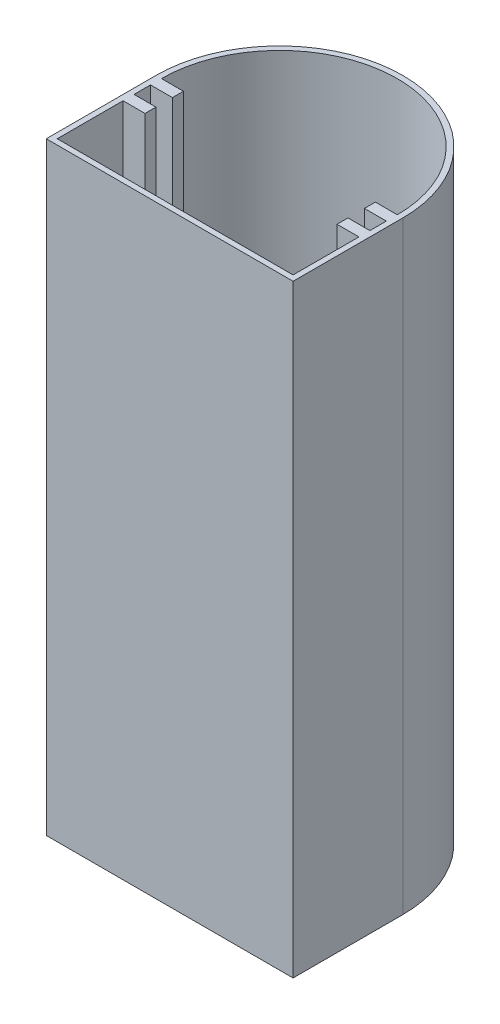
ISO-10303-21;
HEADER;
FILE_DESCRIPTION(('STEP AP214'),'2;1');
FILE_NAME('part.step','',(''),(''),'','','');
FILE_SCHEMA(('AUTOMOTIVE_DESIGN { 1 0 10303 214 1 1 1 1 }'));
ENDSEC;
DATA;
#1=APPLICATION_CONTEXT('core data for automotive mechanical design processes');
#2=APPLICATION_PROTOCOL_DEFINITION('international standard','automotive_design',2000,#1);
#3=PRODUCT_CONTEXT('',#1,'mechanical');
#4=PRODUCT('Part','Part','',(#3));
#5=PRODUCT_RELATED_PRODUCT_CATEGORY('part','',(#4));
#6=PRODUCT_DEFINITION_FORMATION('','',#4);
#7=PRODUCT_DEFINITION_CONTEXT('part definition',#1,'design');
#8=PRODUCT_DEFINITION('design','',#6,#7);
#9=PRODUCT_DEFINITION_SHAPE('','',#8);
#10=(LENGTH_UNIT() NAMED_UNIT(*) SI_UNIT(.MILLI.,.METRE.));
#11=(NAMED_UNIT(*) PLANE_ANGLE_UNIT() SI_UNIT($,.RADIAN.));
#12=(NAMED_UNIT(*) SI_UNIT($,.STERADIAN.) SOLID_ANGLE_UNIT());
#13=UNCERTAINTY_MEASURE_WITH_UNIT(LENGTH_MEASURE(1.E-05),#10,'distance_accuracy_value','');
#14=(GEOMETRIC_REPRESENTATION_CONTEXT(3) GLOBAL_UNCERTAINTY_ASSIGNED_CONTEXT((#13)) GLOBAL_UNIT_ASSIGNED_CONTEXT((#10,
#11,#12)) REPRESENTATION_CONTEXT('',''));
#15=CARTESIAN_POINT('',(0.,0.,0.));
#16=DIRECTION('',(0.,0.,1.));
#17=DIRECTION('',(1.,0.,0.));
#18=AXIS2_PLACEMENT_3D('',#15,#16,#17);
#19=CARTESIAN_POINT('',(-43.8830935251799,110.,1.70773381294964));
#20=DIRECTION('',(0.,0.,-1.));
#21=DIRECTION('',(-1.,0.,0.));
#22=AXIS2_PLACEMENT_3D('',#19,#20,#21);
#23=PLANE('',#22);
#24=DIRECTION('',(1.,0.,0.));
#25=VECTOR('',#24,1.);
#26=CARTESIAN_POINT('',(-43.8830935251799,0.,1.70773381294964));
#27=LINE('',#26,#25);
#28=CARTESIAN_POINT('',(-43.8830935251799,0.,1.70773381294964));
#29=VERTEX_POINT('',#28);
#30=CARTESIAN_POINT('',(1.11690647482014,0.,1.70773381294964));
#31=VERTEX_POINT('',#30);
#32=EDGE_CURVE('E311',#29,#31,#27,.T.);
#33=ORIENTED_EDGE('',*,*,#32,.T.);
#34=DIRECTION('',(0.,-1.,0.));
#35=VECTOR('',#34,1.);
#36=CARTESIAN_POINT('',(1.11690647482014,110.,1.70773381294964));
#37=LINE('',#36,#35);
#38=CARTESIAN_POINT('',(1.11690647482014,110.,1.70773381294964));
#39=VERTEX_POINT('',#38);
#40=EDGE_CURVE('E11',#39,#31,#37,.T.);
#41=ORIENTED_EDGE('',*,*,#40,.F.);
#42=DIRECTION('',(1.,0.,0.));
#43=VECTOR('',#42,1.);
#44=CARTESIAN_POINT('',(-43.8830935251799,110.,1.70773381294964));
#45=LINE('',#44,#43);
#46=CARTESIAN_POINT('',(-43.8830935251799,110.,1.70773381294964));
#47=VERTEX_POINT('',#46);
#48=EDGE_CURVE('E343',#47,#39,#45,.T.);
#49=ORIENTED_EDGE('',*,*,#48,.F.);
#50=DIRECTION('',(0.,-1.,0.));
#51=VECTOR('',#50,1.);
#52=CARTESIAN_POINT('',(-43.8830935251799,110.,1.70773381294964));
#53=LINE('',#52,#51);
#54=EDGE_CURVE('E57',#47,#29,#53,.T.);
#55=ORIENTED_EDGE('',*,*,#54,.T.);
#56=EDGE_LOOP('',(#33,#41,#49,#55));
#57=FACE_BOUND('',#56,.T.);
#58=ADVANCED_FACE('F33',(#57),#23,.F.);
#59=CARTESIAN_POINT('',(1.11690647482014,110.,1.70773381294964));
#60=DIRECTION('',(-1.,0.,0.));
#61=DIRECTION('',(0.,0.,1.));
#62=AXIS2_PLACEMENT_3D('',#59,#60,#61);
#63=PLANE('',#62);
#64=DIRECTION('',(0.,0.,-1.));
#65=VECTOR('',#64,1.);
#66=CARTESIAN_POINT('',(1.11690647482014,0.,1.70773381294964));
#67=LINE('',#66,#65);
#68=CARTESIAN_POINT('',(1.11690647482014,0.,-18.2922661870504));
#69=VERTEX_POINT('',#68);
#70=EDGE_CURVE('E352',#31,#69,#67,.T.);
#71=ORIENTED_EDGE('',*,*,#70,.T.);
#72=DIRECTION('',(0.,-1.,0.));
#73=VECTOR('',#72,1.);
#74=CARTESIAN_POINT('',(1.11690647482014,110.,-18.2922661870504));
#75=LINE('',#74,#73);
#76=CARTESIAN_POINT('',(1.11690647482014,110.,-18.2922661870504));
#77=VERTEX_POINT('',#76);
#78=EDGE_CURVE('E41',#77,#69,#75,.T.);
#79=ORIENTED_EDGE('',*,*,#78,.F.);
#80=DIRECTION('',(0.,0.,-1.));
#81=VECTOR('',#80,1.);
#82=CARTESIAN_POINT('',(1.11690647482014,110.,1.70773381294964));
#83=LINE('',#82,#81);
#84=EDGE_CURVE('E83',#39,#77,#83,.T.);
#85=ORIENTED_EDGE('',*,*,#84,.F.);
#86=ORIENTED_EDGE('',*,*,#40,.T.);
#87=EDGE_LOOP('',(#71,#79,#85,#86));
#88=FACE_BOUND('',#87,.T.);
#89=ADVANCED_FACE('F375',(#88),#63,.F.);
#90=CARTESIAN_POINT('',(-21.3830935251799,110.,-18.2922661870504));
#91=DIRECTION('',(0.,-1.,0.));
#92=DIRECTION('',(0.,0.,-1.));
#93=AXIS2_PLACEMENT_3D('',#90,#91,#92);
#94=CYLINDRICAL_SURFACE('',#93,22.5);
#95=CARTESIAN_POINT('',(-21.3830935251799,0.,-18.2922661870504));
#96=DIRECTION('',(0.,1.,0.));
#97=DIRECTION('',(0.,0.,1.));
#98=AXIS2_PLACEMENT_3D('',#95,#96,#97);
#99=CIRCLE('',#98,22.5);
#100=CARTESIAN_POINT('',(-43.8830935251799,0.,-18.2922661870504));
#101=VERTEX_POINT('',#100);
#102=EDGE_CURVE('E354',#69,#101,#99,.T.);
#103=ORIENTED_EDGE('',*,*,#102,.T.);
#104=DIRECTION('',(0.,-1.,0.));
#105=VECTOR('',#104,1.);
#106=CARTESIAN_POINT('',(-43.8830935251799,110.,-18.2922661870504));
#107=LINE('',#106,#105);
#108=CARTESIAN_POINT('',(-43.8830935251799,110.,-18.2922661870504));
#109=VERTEX_POINT('',#108);
#110=EDGE_CURVE('E360',#109,#101,#107,.T.);
#111=ORIENTED_EDGE('',*,*,#110,.F.);
#112=CARTESIAN_POINT('',(-21.3830935251799,110.,-18.2922661870504));
#113=DIRECTION('',(0.,1.,0.));
#114=DIRECTION('',(0.,0.,1.));
#115=AXIS2_PLACEMENT_3D('',#112,#113,#114);
#116=CIRCLE('',#115,22.5);
#117=EDGE_CURVE('E347',#77,#109,#116,.T.);
#118=ORIENTED_EDGE('',*,*,#117,.F.);
#119=ORIENTED_EDGE('',*,*,#78,.T.);
#120=EDGE_LOOP('',(#103,#111,#118,#119));
#121=FACE_BOUND('',#120,.T.);
#122=ADVANCED_FACE('F366',(#121),#94,.T.);
#123=CARTESIAN_POINT('',(-43.8830935251799,110.,1.70773381294964));
#124=DIRECTION('',(-1.,0.,0.));
#125=DIRECTION('',(0.,0.,1.));
#126=AXIS2_PLACEMENT_3D('',#123,#124,#125);
#127=PLANE('',#126);
#128=CARTESIAN_POINT('',(-43.8830935251799,55.,-4.95893285371703));
#129=DIRECTION('',(-1.,0.,0.));
#130=DIRECTION('',(0.,0.,1.));
#131=AXIS2_PLACEMENT_3D('',#128,#129,#130);
#132=CIRCLE('',#131,2.87500000000001);
#133=CARTESIAN_POINT('',(-43.8830935251799,55.,-2.08393285371702));
#134=VERTEX_POINT('',#133);
#135=EDGE_CURVE('E217',#134,#134,#132,.T.);
#136=ORIENTED_EDGE('',*,*,#135,.F.);
#137=EDGE_LOOP('',(#136));
#138=FACE_BOUND('',#137,.T.);
#139=DIRECTION('',(0.,0.,-1.));
#140=VECTOR('',#139,1.);
#141=CARTESIAN_POINT('',(-43.8830935251799,0.,1.70773381294964));
#142=LINE('',#141,#140);
#143=EDGE_CURVE('E345',#29,#101,#142,.T.);
#144=ORIENTED_EDGE('',*,*,#143,.F.);
#145=ORIENTED_EDGE('',*,*,#54,.F.);
#146=DIRECTION('',(0.,0.,-1.));
#147=VECTOR('',#146,1.);
#148=CARTESIAN_POINT('',(-43.8830935251799,110.,1.70773381294964));
#149=LINE('',#148,#147);
#150=EDGE_CURVE('E349',#47,#109,#149,.T.);
#151=ORIENTED_EDGE('',*,*,#150,.T.);
#152=ORIENTED_EDGE('',*,*,#110,.T.);
#153=EDGE_LOOP('',(#144,#145,#151,#152));
#154=FACE_BOUND('',#153,.T.);
#155=ADVANCED_FACE('F370',(#138,#154),#127,.T.);
#156=CARTESIAN_POINT('',(-21.3830935251799,110.,-18.2922661870504));
#157=DIRECTION('',(0.,1.,0.));
#158=DIRECTION('',(0.,0.,1.));
#159=AXIS2_PLACEMENT_3D('',#156,#157,#158);
#160=PLANE('',#159);
#161=CARTESIAN_POINT('',(-21.3830935251799,110.,-18.2922661870504));
#162=DIRECTION('',(0.,1.,0.));
#163=DIRECTION('',(0.,0.,1.));
#164=AXIS2_PLACEMENT_3D('',#161,#162,#163);
#165=CIRCLE('',#164,21.5);
#166=CARTESIAN_POINT('',(0.116906474820141,110.,-18.2922661870504));
#167=VERTEX_POINT('',#166);
#168=CARTESIAN_POINT('',(-42.8830935251799,110.,-18.2922661870504));
#169=VERTEX_POINT('',#168);
#170=EDGE_CURVE('E48',#167,#169,#165,.T.);
#171=ORIENTED_EDGE('',*,*,#170,.F.);
#172=DIRECTION('',(1.,0.,0.));
#173=VECTOR('',#172,1.);
#174=CARTESIAN_POINT('',(0.116906474820141,110.,-18.2922661870504));
#175=LINE('',#174,#173);
#176=CARTESIAN_POINT('',(-3.88309352517986,110.,-18.2922661870504));
#177=VERTEX_POINT('',#176);
#178=EDGE_CURVE('E211',#177,#167,#175,.T.);
#179=ORIENTED_EDGE('',*,*,#178,.F.);
#180=DIRECTION('',(0.,0.,-1.));
#181=VECTOR('',#180,1.);
#182=CARTESIAN_POINT('',(-3.88309352517986,110.,-18.2922661870504));
#183=LINE('',#182,#181);
#184=CARTESIAN_POINT('',(-3.88309352517986,110.,-16.2922661870504));
#185=VERTEX_POINT('',#184);
#186=EDGE_CURVE('E214',#185,#177,#183,.T.);
#187=ORIENTED_EDGE('',*,*,#186,.F.);
#188=DIRECTION('',(-1.,0.,0.));
#189=VECTOR('',#188,1.);
#190=CARTESIAN_POINT('',(-3.88309352517986,110.,-16.2922661870504));
#191=LINE('',#190,#189);
#192=CARTESIAN_POINT('',(0.116906474820141,110.,-16.2922661870504));
#193=VERTEX_POINT('',#192);
#194=EDGE_CURVE('E304',#193,#185,#191,.T.);
#195=ORIENTED_EDGE('',*,*,#194,.F.);
#196=DIRECTION('',(0.,0.,-1.));
#197=VECTOR('',#196,1.);
#198=CARTESIAN_POINT('',(0.116906474820141,110.,-16.2922661870504));
#199=LINE('',#198,#197);
#200=CARTESIAN_POINT('',(0.116906474820142,110.,-13.2922661870504));
#201=VERTEX_POINT('',#200);
#202=EDGE_CURVE('E301',#201,#193,#199,.T.);
#203=ORIENTED_EDGE('',*,*,#202,.F.);
#204=DIRECTION('',(1.,0.,0.));
#205=VECTOR('',#204,1.);
#206=CARTESIAN_POINT('',(0.116906474820142,110.,-13.2922661870504));
#207=LINE('',#206,#205);
#208=CARTESIAN_POINT('',(-3.88309352517986,110.,-13.2922661870504));
#209=VERTEX_POINT('',#208);
#210=EDGE_CURVE('E298',#209,#201,#207,.T.);
#211=ORIENTED_EDGE('',*,*,#210,.F.);
#212=DIRECTION('',(0.,0.,-1.));
#213=VECTOR('',#212,1.);
#214=CARTESIAN_POINT('',(-3.88309352517986,110.,-13.2922661870504));
#215=LINE('',#214,#213);
#216=CARTESIAN_POINT('',(-3.88309352517986,110.,-11.2922661870504));
#217=VERTEX_POINT('',#216);
#218=EDGE_CURVE('E295',#217,#209,#215,.T.);
#219=ORIENTED_EDGE('',*,*,#218,.F.);
#220=DIRECTION('',(-1.,0.,0.));
#221=VECTOR('',#220,1.);
#222=CARTESIAN_POINT('',(-3.88309352517986,110.,-11.2922661870504));
#223=LINE('',#222,#221);
#224=CARTESIAN_POINT('',(0.116906474820143,110.,-11.2922661870504));
#225=VERTEX_POINT('',#224);
#226=EDGE_CURVE('E292',#225,#217,#223,.T.);
#227=ORIENTED_EDGE('',*,*,#226,.F.);
#228=DIRECTION('',(0.,0.,-1.));
#229=VECTOR('',#228,1.);
#230=CARTESIAN_POINT('',(0.116906474820143,110.,-11.2922661870504));
#231=LINE('',#230,#229);
#232=CARTESIAN_POINT('',(0.116906474820145,110.,0.70773381294964));
#233=VERTEX_POINT('',#232);
#234=EDGE_CURVE('E289',#233,#225,#231,.T.);
#235=ORIENTED_EDGE('',*,*,#234,.F.);
#236=DIRECTION('',(1.,0.,0.));
#237=VECTOR('',#236,1.);
#238=CARTESIAN_POINT('',(-42.8830935251799,110.,0.707733812949641));
#239=LINE('',#238,#237);
#240=CARTESIAN_POINT('',(-42.8830935251799,110.,0.707733812949641));
#241=VERTEX_POINT('',#240);
#242=EDGE_CURVE('E286',#241,#233,#239,.T.);
#243=ORIENTED_EDGE('',*,*,#242,.F.);
#244=DIRECTION('',(0.,0.,1.));
#245=VECTOR('',#244,1.);
#246=CARTESIAN_POINT('',(-42.8830935251799,110.,-11.2922661870504));
#247=LINE('',#246,#245);
#248=CARTESIAN_POINT('',(-42.8830935251799,110.,-11.2922661870504));
#249=VERTEX_POINT('',#248);
#250=EDGE_CURVE('E283',#249,#241,#247,.T.);
#251=ORIENTED_EDGE('',*,*,#250,.F.);
#252=DIRECTION('',(-1.,0.,0.));
#253=VECTOR('',#252,1.);
#254=CARTESIAN_POINT('',(-38.8830935251799,110.,-11.2922661870504));
#255=LINE('',#254,#253);
#256=CARTESIAN_POINT('',(-38.8830935251799,110.,-11.2922661870504));
#257=VERTEX_POINT('',#256);
#258=EDGE_CURVE('E280',#257,#249,#255,.T.);
#259=ORIENTED_EDGE('',*,*,#258,.F.);
#260=DIRECTION('',(0.,0.,1.));
#261=VECTOR('',#260,1.);
#262=CARTESIAN_POINT('',(-38.8830935251799,110.,-13.2922661870504));
#263=LINE('',#262,#261);
#264=CARTESIAN_POINT('',(-38.8830935251799,110.,-13.2922661870504));
#265=VERTEX_POINT('',#264);
#266=EDGE_CURVE('E277',#265,#257,#263,.T.);
#267=ORIENTED_EDGE('',*,*,#266,.F.);
#268=DIRECTION('',(1.,0.,0.));
#269=VECTOR('',#268,1.);
#270=CARTESIAN_POINT('',(-42.8830935251799,110.,-13.2922661870504));
#271=LINE('',#270,#269);
#272=CARTESIAN_POINT('',(-42.8830935251799,110.,-13.2922661870504));
#273=VERTEX_POINT('',#272);
#274=EDGE_CURVE('E274',#273,#265,#271,.T.);
#275=ORIENTED_EDGE('',*,*,#274,.F.);
#276=DIRECTION('',(0.,0.,1.));
#277=VECTOR('',#276,1.);
#278=CARTESIAN_POINT('',(-42.8830935251799,110.,-16.2922661870504));
#279=LINE('',#278,#277);
#280=CARTESIAN_POINT('',(-42.8830935251799,110.,-16.2922661870504));
#281=VERTEX_POINT('',#280);
#282=EDGE_CURVE('E271',#281,#273,#279,.T.);
#283=ORIENTED_EDGE('',*,*,#282,.F.);
#284=DIRECTION('',(-1.,0.,0.));
#285=VECTOR('',#284,1.);
#286=CARTESIAN_POINT('',(-38.8830935251799,110.,-16.2922661870504));
#287=LINE('',#286,#285);
#288=CARTESIAN_POINT('',(-38.8830935251799,110.,-16.2922661870504));
#289=VERTEX_POINT('',#288);
#290=EDGE_CURVE('E268',#289,#281,#287,.T.);
#291=ORIENTED_EDGE('',*,*,#290,.F.);
#292=DIRECTION('',(0.,0.,1.));
#293=VECTOR('',#292,1.);
#294=CARTESIAN_POINT('',(-38.8830935251799,110.,-18.2922661870504));
#295=LINE('',#294,#293);
#296=CARTESIAN_POINT('',(-38.8830935251799,110.,-18.2922661870504));
#297=VERTEX_POINT('',#296);
#298=EDGE_CURVE('E265',#297,#289,#295,.T.);
#299=ORIENTED_EDGE('',*,*,#298,.F.);
#300=DIRECTION('',(1.,0.,0.));
#301=VECTOR('',#300,1.);
#302=CARTESIAN_POINT('',(-42.8830935251799,110.,-18.2922661870504));
#303=LINE('',#302,#301);
#304=EDGE_CURVE('E263',#169,#297,#303,.T.);
#305=ORIENTED_EDGE('',*,*,#304,.F.);
#306=EDGE_LOOP('',(#171,#179,#187,#195,#203,#211,#219,#227,#235,#243,#251,#259,#267,#275,#283,
#291,#299,#305));
#307=FACE_BOUND('',#306,.T.);
#308=ORIENTED_EDGE('',*,*,#48,.T.);
#309=ORIENTED_EDGE('',*,*,#84,.T.);
#310=ORIENTED_EDGE('',*,*,#117,.T.);
#311=ORIENTED_EDGE('',*,*,#150,.F.);
#312=EDGE_LOOP('',(#308,#309,#310,#311));
#313=FACE_BOUND('',#312,.T.);
#314=ADVANCED_FACE('F373',(#307,#313),#160,.T.);
#315=CARTESIAN_POINT('',(-21.3830935251799,0.,-18.2922661870504));
#316=DIRECTION('',(0.,1.,0.));
#317=DIRECTION('',(0.,0.,1.));
#318=AXIS2_PLACEMENT_3D('',#315,#316,#317);
#319=PLANE('',#318);
#320=ORIENTED_EDGE('',*,*,#32,.F.);
#321=ORIENTED_EDGE('',*,*,#143,.T.);
#322=ORIENTED_EDGE('',*,*,#102,.F.);
#323=ORIENTED_EDGE('',*,*,#70,.F.);
#324=EDGE_LOOP('',(#320,#321,#322,#323));
#325=FACE_BOUND('',#324,.T.);
#326=ADVANCED_FACE('F369',(#325),#319,.F.);
#327=CARTESIAN_POINT('',(-21.3830935251799,1.,-18.2922661870504));
#328=DIRECTION('',(0.,1.,0.));
#329=DIRECTION('',(0.,0.,1.));
#330=AXIS2_PLACEMENT_3D('',#327,#328,#329);
#331=CYLINDRICAL_SURFACE('',#330,21.5);
#332=ORIENTED_EDGE('',*,*,#170,.T.);
#333=DIRECTION('',(0.,1.,0.));
#334=VECTOR('',#333,1.);
#335=CARTESIAN_POINT('',(-42.8830935251799,1.,-18.2922661870504));
#336=LINE('',#335,#334);
#337=CARTESIAN_POINT('',(-42.8830935251799,1.,-18.2922661870504));
#338=VERTEX_POINT('',#337);
#339=EDGE_CURVE('E188',#338,#169,#336,.T.);
#340=ORIENTED_EDGE('',*,*,#339,.F.);
#341=CARTESIAN_POINT('',(-21.3830935251799,1.,-18.2922661870504));
#342=DIRECTION('',(0.,1.,0.));
#343=DIRECTION('',(0.,0.,1.));
#344=AXIS2_PLACEMENT_3D('',#341,#342,#343);
#345=CIRCLE('',#344,21.5);
#346=CARTESIAN_POINT('',(0.116906474820141,1.,-18.2922661870504));
#347=VERTEX_POINT('',#346);
#348=EDGE_CURVE('E192',#347,#338,#345,.T.);
#349=ORIENTED_EDGE('',*,*,#348,.F.);
#350=DIRECTION('',(0.,1.,0.));
#351=VECTOR('',#350,1.);
#352=CARTESIAN_POINT('',(0.116906474820141,1.,-18.2922661870504));
#353=LINE('',#352,#351);
#354=EDGE_CURVE('E309',#347,#167,#353,.T.);
#355=ORIENTED_EDGE('',*,*,#354,.T.);
#356=EDGE_LOOP('',(#332,#340,#349,#355));
#357=FACE_BOUND('',#356,.T.);
#358=ADVANCED_FACE('F190',(#357),#331,.F.);
#359=CARTESIAN_POINT('',(0.116906474820141,1.,-18.2922661870504));
#360=DIRECTION('',(0.,0.,1.));
#361=DIRECTION('',(1.,0.,0.));
#362=AXIS2_PLACEMENT_3D('',#359,#360,#361);
#363=PLANE('',#362);
#364=ORIENTED_EDGE('',*,*,#178,.T.);
#365=ORIENTED_EDGE('',*,*,#354,.F.);
#366=DIRECTION('',(1.,0.,0.));
#367=VECTOR('',#366,1.);
#368=CARTESIAN_POINT('',(0.116906474820141,1.,-18.2922661870504));
#369=LINE('',#368,#367);
#370=CARTESIAN_POINT('',(-3.88309352517986,1.,-18.2922661870504));
#371=VERTEX_POINT('',#370);
#372=EDGE_CURVE('E198',#371,#347,#369,.T.);
#373=ORIENTED_EDGE('',*,*,#372,.F.);
#374=DIRECTION('',(0.,1.,0.));
#375=VECTOR('',#374,1.);
#376=CARTESIAN_POINT('',(-3.88309352517986,1.,-18.2922661870504));
#377=LINE('',#376,#375);
#378=EDGE_CURVE('E312',#371,#177,#377,.T.);
#379=ORIENTED_EDGE('',*,*,#378,.T.);
#380=EDGE_LOOP('',(#364,#365,#373,#379));
#381=FACE_BOUND('',#380,.T.);
#382=ADVANCED_FACE('F393',(#381),#363,.F.);
#383=CARTESIAN_POINT('',(-3.88309352517986,1.,-18.2922661870504));
#384=DIRECTION('',(1.,0.,0.));
#385=DIRECTION('',(0.,0.,-1.));
#386=AXIS2_PLACEMENT_3D('',#383,#384,#385);
#387=PLANE('',#386);
#388=ORIENTED_EDGE('',*,*,#186,.T.);
#389=ORIENTED_EDGE('',*,*,#378,.F.);
#390=DIRECTION('',(0.,0.,-1.));
#391=VECTOR('',#390,1.);
#392=CARTESIAN_POINT('',(-3.88309352517986,1.,-18.2922661870504));
#393=LINE('',#392,#391);
#394=CARTESIAN_POINT('',(-3.88309352517986,1.,-16.2922661870504));
#395=VERTEX_POINT('',#394);
#396=EDGE_CURVE('E259',#395,#371,#393,.T.);
#397=ORIENTED_EDGE('',*,*,#396,.F.);
#398=DIRECTION('',(0.,1.,0.));
#399=VECTOR('',#398,1.);
#400=CARTESIAN_POINT('',(-3.88309352517986,1.,-16.2922661870504));
#401=LINE('',#400,#399);
#402=EDGE_CURVE('E314',#395,#185,#401,.T.);
#403=ORIENTED_EDGE('',*,*,#402,.T.);
#404=EDGE_LOOP('',(#388,#389,#397,#403));
#405=FACE_BOUND('',#404,.T.);
#406=ADVANCED_FACE('F451',(#405),#387,.F.);
#407=CARTESIAN_POINT('',(-3.88309352517986,1.,-16.2922661870504));
#408=DIRECTION('',(0.,0.,-1.));
#409=DIRECTION('',(-1.,0.,0.));
#410=AXIS2_PLACEMENT_3D('',#407,#408,#409);
#411=PLANE('',#410);
#412=ORIENTED_EDGE('',*,*,#194,.T.);
#413=ORIENTED_EDGE('',*,*,#402,.F.);
#414=DIRECTION('',(-1.,0.,0.));
#415=VECTOR('',#414,1.);
#416=CARTESIAN_POINT('',(-3.88309352517986,1.,-16.2922661870504));
#417=LINE('',#416,#415);
#418=CARTESIAN_POINT('',(0.116906474820141,1.,-16.2922661870504));
#419=VERTEX_POINT('',#418);
#420=EDGE_CURVE('E256',#419,#395,#417,.T.);
#421=ORIENTED_EDGE('',*,*,#420,.F.);
#422=DIRECTION('',(0.,1.,0.));
#423=VECTOR('',#422,1.);
#424=CARTESIAN_POINT('',(0.116906474820141,1.,-16.2922661870504));
#425=LINE('',#424,#423);
#426=EDGE_CURVE('E316',#419,#193,#425,.T.);
#427=ORIENTED_EDGE('',*,*,#426,.T.);
#428=EDGE_LOOP('',(#412,#413,#421,#427));
#429=FACE_BOUND('',#428,.T.);
#430=ADVANCED_FACE('F447',(#429),#411,.F.);
#431=CARTESIAN_POINT('',(0.116906474820141,1.,-16.2922661870504));
#432=DIRECTION('',(1.,0.,0.));
#433=DIRECTION('',(0.,0.,-1.));
#434=AXIS2_PLACEMENT_3D('',#431,#432,#433);
#435=PLANE('',#434);
#436=ORIENTED_EDGE('',*,*,#202,.T.);
#437=ORIENTED_EDGE('',*,*,#426,.F.);
#438=DIRECTION('',(0.,0.,-1.));
#439=VECTOR('',#438,1.);
#440=CARTESIAN_POINT('',(0.116906474820141,1.,-16.2922661870504));
#441=LINE('',#440,#439);
#442=CARTESIAN_POINT('',(0.116906474820142,1.,-13.2922661870504));
#443=VERTEX_POINT('',#442);
#444=EDGE_CURVE('E253',#443,#419,#441,.T.);
#445=ORIENTED_EDGE('',*,*,#444,.F.);
#446=DIRECTION('',(0.,1.,0.));
#447=VECTOR('',#446,1.);
#448=CARTESIAN_POINT('',(0.116906474820142,1.,-13.2922661870504));
#449=LINE('',#448,#447);
#450=EDGE_CURVE('E318',#443,#201,#449,.T.);
#451=ORIENTED_EDGE('',*,*,#450,.T.);
#452=EDGE_LOOP('',(#436,#437,#445,#451));
#453=FACE_BOUND('',#452,.T.);
#454=ADVANCED_FACE('F443',(#453),#435,.F.);
#455=CARTESIAN_POINT('',(0.116906474820142,1.,-13.2922661870504));
#456=DIRECTION('',(0.,0.,1.));
#457=DIRECTION('',(1.,0.,0.));
#458=AXIS2_PLACEMENT_3D('',#455,#456,#457);
#459=PLANE('',#458);
#460=ORIENTED_EDGE('',*,*,#210,.T.);
#461=ORIENTED_EDGE('',*,*,#450,.F.);
#462=DIRECTION('',(1.,0.,0.));
#463=VECTOR('',#462,1.);
#464=CARTESIAN_POINT('',(0.116906474820142,1.,-13.2922661870504));
#465=LINE('',#464,#463);
#466=CARTESIAN_POINT('',(-3.88309352517986,1.,-13.2922661870504));
#467=VERTEX_POINT('',#466);
#468=EDGE_CURVE('E250',#467,#443,#465,.T.);
#469=ORIENTED_EDGE('',*,*,#468,.F.);
#470=DIRECTION('',(0.,1.,0.));
#471=VECTOR('',#470,1.);
#472=CARTESIAN_POINT('',(-3.88309352517986,1.,-13.2922661870504));
#473=LINE('',#472,#471);
#474=EDGE_CURVE('E320',#467,#209,#473,.T.);
#475=ORIENTED_EDGE('',*,*,#474,.T.);
#476=EDGE_LOOP('',(#460,#461,#469,#475));
#477=FACE_BOUND('',#476,.T.);
#478=ADVANCED_FACE('F439',(#477),#459,.F.);
#479=CARTESIAN_POINT('',(-3.88309352517986,1.,-13.2922661870504));
#480=DIRECTION('',(1.,0.,0.));
#481=DIRECTION('',(0.,0.,-1.));
#482=AXIS2_PLACEMENT_3D('',#479,#480,#481);
#483=PLANE('',#482);
#484=ORIENTED_EDGE('',*,*,#218,.T.);
#485=ORIENTED_EDGE('',*,*,#474,.F.);
#486=DIRECTION('',(0.,0.,-1.));
#487=VECTOR('',#486,1.);
#488=CARTESIAN_POINT('',(-3.88309352517986,1.,-13.2922661870504));
#489=LINE('',#488,#487);
#490=CARTESIAN_POINT('',(-3.88309352517986,1.,-11.2922661870504));
#491=VERTEX_POINT('',#490);
#492=EDGE_CURVE('E247',#491,#467,#489,.T.);
#493=ORIENTED_EDGE('',*,*,#492,.F.);
#494=DIRECTION('',(0.,1.,0.));
#495=VECTOR('',#494,1.);
#496=CARTESIAN_POINT('',(-3.88309352517986,1.,-11.2922661870504));
#497=LINE('',#496,#495);
#498=EDGE_CURVE('E322',#491,#217,#497,.T.);
#499=ORIENTED_EDGE('',*,*,#498,.T.);
#500=EDGE_LOOP('',(#484,#485,#493,#499));
#501=FACE_BOUND('',#500,.T.);
#502=ADVANCED_FACE('F435',(#501),#483,.F.);
#503=CARTESIAN_POINT('',(-3.88309352517986,1.,-11.2922661870504));
#504=DIRECTION('',(0.,0.,-1.));
#505=DIRECTION('',(-1.,0.,0.));
#506=AXIS2_PLACEMENT_3D('',#503,#504,#505);
#507=PLANE('',#506);
#508=ORIENTED_EDGE('',*,*,#226,.T.);
#509=ORIENTED_EDGE('',*,*,#498,.F.);
#510=DIRECTION('',(-1.,0.,0.));
#511=VECTOR('',#510,1.);
#512=CARTESIAN_POINT('',(-3.88309352517986,1.,-11.2922661870504));
#513=LINE('',#512,#511);
#514=CARTESIAN_POINT('',(0.116906474820143,1.,-11.2922661870504));
#515=VERTEX_POINT('',#514);
#516=EDGE_CURVE('E244',#515,#491,#513,.T.);
#517=ORIENTED_EDGE('',*,*,#516,.F.);
#518=DIRECTION('',(0.,1.,0.));
#519=VECTOR('',#518,1.);
#520=CARTESIAN_POINT('',(0.116906474820143,1.,-11.2922661870504));
#521=LINE('',#520,#519);
#522=EDGE_CURVE('E324',#515,#225,#521,.T.);
#523=ORIENTED_EDGE('',*,*,#522,.T.);
#524=EDGE_LOOP('',(#508,#509,#517,#523));
#525=FACE_BOUND('',#524,.T.);
#526=ADVANCED_FACE('F431',(#525),#507,.F.);
#527=CARTESIAN_POINT('',(0.116906474820143,1.,-11.2922661870504));
#528=DIRECTION('',(1.,0.,0.));
#529=DIRECTION('',(0.,0.,-1.));
#530=AXIS2_PLACEMENT_3D('',#527,#528,#529);
#531=PLANE('',#530);
#532=ORIENTED_EDGE('',*,*,#234,.T.);
#533=ORIENTED_EDGE('',*,*,#522,.F.);
#534=DIRECTION('',(0.,0.,-1.));
#535=VECTOR('',#534,1.);
#536=CARTESIAN_POINT('',(0.116906474820143,1.,-11.2922661870504));
#537=LINE('',#536,#535);
#538=CARTESIAN_POINT('',(0.116906474820145,1.,0.70773381294964));
#539=VERTEX_POINT('',#538);
#540=EDGE_CURVE('E241',#539,#515,#537,.T.);
#541=ORIENTED_EDGE('',*,*,#540,.F.);
#542=DIRECTION('',(0.,1.,0.));
#543=VECTOR('',#542,1.);
#544=CARTESIAN_POINT('',(0.116906474820145,1.,0.70773381294964));
#545=LINE('',#544,#543);
#546=EDGE_CURVE('E326',#539,#233,#545,.T.);
#547=ORIENTED_EDGE('',*,*,#546,.T.);
#548=EDGE_LOOP('',(#532,#533,#541,#547));
#549=FACE_BOUND('',#548,.T.);
#550=ADVANCED_FACE('F427',(#549),#531,.F.);
#551=CARTESIAN_POINT('',(-42.8830935251799,1.,0.707733812949641));
#552=DIRECTION('',(0.,0.,1.));
#553=DIRECTION('',(1.,0.,0.));
#554=AXIS2_PLACEMENT_3D('',#551,#552,#553);
#555=PLANE('',#554);
#556=ORIENTED_EDGE('',*,*,#242,.T.);
#557=ORIENTED_EDGE('',*,*,#546,.F.);
#558=DIRECTION('',(1.,0.,0.));
#559=VECTOR('',#558,1.);
#560=CARTESIAN_POINT('',(-42.8830935251799,1.,0.707733812949641));
#561=LINE('',#560,#559);
#562=CARTESIAN_POINT('',(-42.8830935251799,1.,0.707733812949641));
#563=VERTEX_POINT('',#562);
#564=EDGE_CURVE('E238',#563,#539,#561,.T.);
#565=ORIENTED_EDGE('',*,*,#564,.F.);
#566=DIRECTION('',(0.,1.,0.));
#567=VECTOR('',#566,1.);
#568=CARTESIAN_POINT('',(-42.8830935251799,1.,0.707733812949641));
#569=LINE('',#568,#567);
#570=EDGE_CURVE('E328',#563,#241,#569,.T.);
#571=ORIENTED_EDGE('',*,*,#570,.T.);
#572=EDGE_LOOP('',(#556,#557,#565,#571));
#573=FACE_BOUND('',#572,.T.);
#574=ADVANCED_FACE('F423',(#573),#555,.F.);
#575=CARTESIAN_POINT('',(-42.8830935251799,1.,-11.2922661870504));
#576=DIRECTION('',(-1.,0.,0.));
#577=DIRECTION('',(0.,0.,1.));
#578=AXIS2_PLACEMENT_3D('',#575,#576,#577);
#579=PLANE('',#578);
#580=CARTESIAN_POINT('',(-42.8830935251799,55.,-4.95893285371703));
#581=DIRECTION('',(-1.,0.,0.));
#582=DIRECTION('',(0.,0.,1.));
#583=AXIS2_PLACEMENT_3D('',#580,#581,#582);
#584=CIRCLE('',#583,2.87500000000001);
#585=CARTESIAN_POINT('',(-42.8830935251799,55.,-2.08393285371702));
#586=VERTEX_POINT('',#585);
#587=EDGE_CURVE('E36',#586,#586,#584,.T.);
#588=ORIENTED_EDGE('',*,*,#587,.T.);
#589=EDGE_LOOP('',(#588));
#590=FACE_BOUND('',#589,.T.);
#591=ORIENTED_EDGE('',*,*,#250,.T.);
#592=ORIENTED_EDGE('',*,*,#570,.F.);
#593=DIRECTION('',(0.,0.,1.));
#594=VECTOR('',#593,1.);
#595=CARTESIAN_POINT('',(-42.8830935251799,1.,-11.2922661870504));
#596=LINE('',#595,#594);
#597=CARTESIAN_POINT('',(-42.8830935251799,1.,-11.2922661870504));
#598=VERTEX_POINT('',#597);
#599=EDGE_CURVE('E235',#598,#563,#596,.T.);
#600=ORIENTED_EDGE('',*,*,#599,.F.);
#601=DIRECTION('',(0.,1.,0.));
#602=VECTOR('',#601,1.);
#603=CARTESIAN_POINT('',(-42.8830935251799,1.,-11.2922661870504));
#604=LINE('',#603,#602);
#605=EDGE_CURVE('E330',#598,#249,#604,.T.);
#606=ORIENTED_EDGE('',*,*,#605,.T.);
#607=EDGE_LOOP('',(#591,#592,#600,#606));
#608=FACE_BOUND('',#607,.T.);
#609=ADVANCED_FACE('F419',(#590,#608),#579,.F.);
#610=CARTESIAN_POINT('',(-38.8830935251799,1.,-11.2922661870504));
#611=DIRECTION('',(0.,0.,-1.));
#612=DIRECTION('',(-1.,0.,0.));
#613=AXIS2_PLACEMENT_3D('',#610,#611,#612);
#614=PLANE('',#613);
#615=ORIENTED_EDGE('',*,*,#258,.T.);
#616=ORIENTED_EDGE('',*,*,#605,.F.);
#617=DIRECTION('',(-1.,0.,0.));
#618=VECTOR('',#617,1.);
#619=CARTESIAN_POINT('',(-38.8830935251799,1.,-11.2922661870504));
#620=LINE('',#619,#618);
#621=CARTESIAN_POINT('',(-38.8830935251799,1.,-11.2922661870504));
#622=VERTEX_POINT('',#621);
#623=EDGE_CURVE('E232',#622,#598,#620,.T.);
#624=ORIENTED_EDGE('',*,*,#623,.F.);
#625=DIRECTION('',(0.,1.,0.));
#626=VECTOR('',#625,1.);
#627=CARTESIAN_POINT('',(-38.8830935251799,1.,-11.2922661870504));
#628=LINE('',#627,#626);
#629=EDGE_CURVE('E332',#622,#257,#628,.T.);
#630=ORIENTED_EDGE('',*,*,#629,.T.);
#631=EDGE_LOOP('',(#615,#616,#624,#630));
#632=FACE_BOUND('',#631,.T.);
#633=ADVANCED_FACE('F415',(#632),#614,.F.);
#634=CARTESIAN_POINT('',(-38.8830935251799,1.,-13.2922661870504));
#635=DIRECTION('',(-1.,0.,0.));
#636=DIRECTION('',(0.,0.,1.));
#637=AXIS2_PLACEMENT_3D('',#634,#635,#636);
#638=PLANE('',#637);
#639=ORIENTED_EDGE('',*,*,#266,.T.);
#640=ORIENTED_EDGE('',*,*,#629,.F.);
#641=DIRECTION('',(0.,0.,1.));
#642=VECTOR('',#641,1.);
#643=CARTESIAN_POINT('',(-38.8830935251799,1.,-13.2922661870504));
#644=LINE('',#643,#642);
#645=CARTESIAN_POINT('',(-38.8830935251799,1.,-13.2922661870504));
#646=VERTEX_POINT('',#645);
#647=EDGE_CURVE('E229',#646,#622,#644,.T.);
#648=ORIENTED_EDGE('',*,*,#647,.F.);
#649=DIRECTION('',(0.,1.,0.));
#650=VECTOR('',#649,1.);
#651=CARTESIAN_POINT('',(-38.8830935251799,1.,-13.2922661870504));
#652=LINE('',#651,#650);
#653=EDGE_CURVE('E334',#646,#265,#652,.T.);
#654=ORIENTED_EDGE('',*,*,#653,.T.);
#655=EDGE_LOOP('',(#639,#640,#648,#654));
#656=FACE_BOUND('',#655,.T.);
#657=ADVANCED_FACE('F411',(#656),#638,.F.);
#658=CARTESIAN_POINT('',(-42.8830935251799,1.,-13.2922661870504));
#659=DIRECTION('',(0.,0.,1.));
#660=DIRECTION('',(1.,0.,0.));
#661=AXIS2_PLACEMENT_3D('',#658,#659,#660);
#662=PLANE('',#661);
#663=ORIENTED_EDGE('',*,*,#274,.T.);
#664=ORIENTED_EDGE('',*,*,#653,.F.);
#665=DIRECTION('',(1.,0.,0.));
#666=VECTOR('',#665,1.);
#667=CARTESIAN_POINT('',(-42.8830935251799,1.,-13.2922661870504));
#668=LINE('',#667,#666);
#669=CARTESIAN_POINT('',(-42.8830935251799,1.,-13.2922661870504));
#670=VERTEX_POINT('',#669);
#671=EDGE_CURVE('E226',#670,#646,#668,.T.);
#672=ORIENTED_EDGE('',*,*,#671,.F.);
#673=DIRECTION('',(0.,1.,0.));
#674=VECTOR('',#673,1.);
#675=CARTESIAN_POINT('',(-42.8830935251799,1.,-13.2922661870504));
#676=LINE('',#675,#674);
#677=EDGE_CURVE('E336',#670,#273,#676,.T.);
#678=ORIENTED_EDGE('',*,*,#677,.T.);
#679=EDGE_LOOP('',(#663,#664,#672,#678));
#680=FACE_BOUND('',#679,.T.);
#681=ADVANCED_FACE('F407',(#680),#662,.F.);
#682=CARTESIAN_POINT('',(-42.8830935251799,1.,-16.2922661870504));
#683=DIRECTION('',(-1.,0.,0.));
#684=DIRECTION('',(0.,0.,1.));
#685=AXIS2_PLACEMENT_3D('',#682,#683,#684);
#686=PLANE('',#685);
#687=ORIENTED_EDGE('',*,*,#282,.T.);
#688=ORIENTED_EDGE('',*,*,#677,.F.);
#689=DIRECTION('',(0.,0.,1.));
#690=VECTOR('',#689,1.);
#691=CARTESIAN_POINT('',(-42.8830935251799,1.,-16.2922661870504));
#692=LINE('',#691,#690);
#693=CARTESIAN_POINT('',(-42.8830935251799,1.,-16.2922661870504));
#694=VERTEX_POINT('',#693);
#695=EDGE_CURVE('E223',#694,#670,#692,.T.);
#696=ORIENTED_EDGE('',*,*,#695,.F.);
#697=DIRECTION('',(0.,1.,0.));
#698=VECTOR('',#697,1.);
#699=CARTESIAN_POINT('',(-42.8830935251799,1.,-16.2922661870504));
#700=LINE('',#699,#698);
#701=EDGE_CURVE('E338',#694,#281,#700,.T.);
#702=ORIENTED_EDGE('',*,*,#701,.T.);
#703=EDGE_LOOP('',(#687,#688,#696,#702));
#704=FACE_BOUND('',#703,.T.);
#705=ADVANCED_FACE('F403',(#704),#686,.F.);
#706=CARTESIAN_POINT('',(-38.8830935251799,1.,-16.2922661870504));
#707=DIRECTION('',(0.,0.,-1.));
#708=DIRECTION('',(-1.,0.,0.));
#709=AXIS2_PLACEMENT_3D('',#706,#707,#708);
#710=PLANE('',#709);
#711=ORIENTED_EDGE('',*,*,#290,.T.);
#712=ORIENTED_EDGE('',*,*,#701,.F.);
#713=DIRECTION('',(-1.,0.,0.));
#714=VECTOR('',#713,1.);
#715=CARTESIAN_POINT('',(-38.8830935251799,1.,-16.2922661870504));
#716=LINE('',#715,#714);
#717=CARTESIAN_POINT('',(-38.8830935251799,1.,-16.2922661870504));
#718=VERTEX_POINT('',#717);
#719=EDGE_CURVE('E220',#718,#694,#716,.T.);
#720=ORIENTED_EDGE('',*,*,#719,.F.);
#721=DIRECTION('',(0.,1.,0.));
#722=VECTOR('',#721,1.);
#723=CARTESIAN_POINT('',(-38.8830935251799,1.,-16.2922661870504));
#724=LINE('',#723,#722);
#725=EDGE_CURVE('E340',#718,#289,#724,.T.);
#726=ORIENTED_EDGE('',*,*,#725,.T.);
#727=EDGE_LOOP('',(#711,#712,#720,#726));
#728=FACE_BOUND('',#727,.T.);
#729=ADVANCED_FACE('F399',(#728),#710,.F.);
#730=CARTESIAN_POINT('',(-38.8830935251799,1.,-18.2922661870504));
#731=DIRECTION('',(-1.,0.,0.));
#732=DIRECTION('',(0.,0.,1.));
#733=AXIS2_PLACEMENT_3D('',#730,#731,#732);
#734=PLANE('',#733);
#735=ORIENTED_EDGE('',*,*,#298,.T.);
#736=ORIENTED_EDGE('',*,*,#725,.F.);
#737=DIRECTION('',(0.,0.,1.));
#738=VECTOR('',#737,1.);
#739=CARTESIAN_POINT('',(-38.8830935251799,1.,-18.2922661870504));
#740=LINE('',#739,#738);
#741=CARTESIAN_POINT('',(-38.8830935251799,1.,-18.2922661870504));
#742=VERTEX_POINT('',#741);
#743=EDGE_CURVE('E206',#742,#718,#740,.T.);
#744=ORIENTED_EDGE('',*,*,#743,.F.);
#745=DIRECTION('',(0.,1.,0.));
#746=VECTOR('',#745,1.);
#747=CARTESIAN_POINT('',(-38.8830935251799,1.,-18.2922661870504));
#748=LINE('',#747,#746);
#749=EDGE_CURVE('E197',#742,#297,#748,.T.);
#750=ORIENTED_EDGE('',*,*,#749,.T.);
#751=EDGE_LOOP('',(#735,#736,#744,#750));
#752=FACE_BOUND('',#751,.T.);
#753=ADVANCED_FACE('F396',(#752),#734,.F.);
#754=CARTESIAN_POINT('',(-42.8830935251799,1.,-18.2922661870504));
#755=DIRECTION('',(0.,0.,1.));
#756=DIRECTION('',(1.,0.,0.));
#757=AXIS2_PLACEMENT_3D('',#754,#755,#756);
#758=PLANE('',#757);
#759=ORIENTED_EDGE('',*,*,#304,.T.);
#760=ORIENTED_EDGE('',*,*,#749,.F.);
#761=DIRECTION('',(1.,0.,0.));
#762=VECTOR('',#761,1.);
#763=CARTESIAN_POINT('',(-42.8830935251799,1.,-18.2922661870504));
#764=LINE('',#763,#762);
#765=EDGE_CURVE('E201',#338,#742,#764,.T.);
#766=ORIENTED_EDGE('',*,*,#765,.F.);
#767=ORIENTED_EDGE('',*,*,#339,.T.);
#768=EDGE_LOOP('',(#759,#760,#766,#767));
#769=FACE_BOUND('',#768,.T.);
#770=ADVANCED_FACE('F202',(#769),#758,.F.);
#771=CARTESIAN_POINT('',(-21.3830935251799,1.,-18.2922661870504));
#772=DIRECTION('',(0.,1.,0.));
#773=DIRECTION('',(0.,0.,1.));
#774=AXIS2_PLACEMENT_3D('',#771,#772,#773);
#775=PLANE('',#774);
#776=ORIENTED_EDGE('',*,*,#348,.T.);
#777=ORIENTED_EDGE('',*,*,#765,.T.);
#778=ORIENTED_EDGE('',*,*,#743,.T.);
#779=ORIENTED_EDGE('',*,*,#719,.T.);
#780=ORIENTED_EDGE('',*,*,#695,.T.);
#781=ORIENTED_EDGE('',*,*,#671,.T.);
#782=ORIENTED_EDGE('',*,*,#647,.T.);
#783=ORIENTED_EDGE('',*,*,#623,.T.);
#784=ORIENTED_EDGE('',*,*,#599,.T.);
#785=ORIENTED_EDGE('',*,*,#564,.T.);
#786=ORIENTED_EDGE('',*,*,#540,.T.);
#787=ORIENTED_EDGE('',*,*,#516,.T.);
#788=ORIENTED_EDGE('',*,*,#492,.T.);
#789=ORIENTED_EDGE('',*,*,#468,.T.);
#790=ORIENTED_EDGE('',*,*,#444,.T.);
#791=ORIENTED_EDGE('',*,*,#420,.T.);
#792=ORIENTED_EDGE('',*,*,#396,.T.);
#793=ORIENTED_EDGE('',*,*,#372,.T.);
#794=EDGE_LOOP('',(#776,#777,#778,#779,#780,#781,#782,#783,#784,#785,#786,#787,#788,#789,#790,
#791,#792,#793));
#795=FACE_BOUND('',#794,.T.);
#796=ADVANCED_FACE('F208',(#795),#775,.T.);
#797=CARTESIAN_POINT('',(-38.8830935251799,55.,-4.95893285371703));
#798=DIRECTION('',(-1.,0.,0.));
#799=DIRECTION('',(0.,0.,1.));
#800=AXIS2_PLACEMENT_3D('',#797,#798,#799);
#801=CYLINDRICAL_SURFACE('',#800,2.87500000000001);
#802=ORIENTED_EDGE('',*,*,#135,.T.);
#803=EDGE_LOOP('',(#802));
#804=FACE_BOUND('',#803,.T.);
#805=ORIENTED_EDGE('',*,*,#587,.F.);
#806=EDGE_LOOP('',(#805));
#807=FACE_BOUND('',#806,.T.);
#808=ADVANCED_FACE('F461',(#804,#807),#801,.F.);
#809=CLOSED_SHELL('',(#58,#89,#122,#155,#314,#326,#358,#382,#406,#430,#454,#478,#502,#526,#550,
#574,#609,#633,#657,#681,#705,#729,#753,#770,#796,#808));
#810=MANIFOLD_SOLID_BREP('B2',#809);
#811=ADVANCED_BREP_SHAPE_REPRESENTATION('',(#18,#810),#14);
#812=SHAPE_DEFINITION_REPRESENTATION(#9,#811);
ENDSEC;
END-ISO-10303-21;
